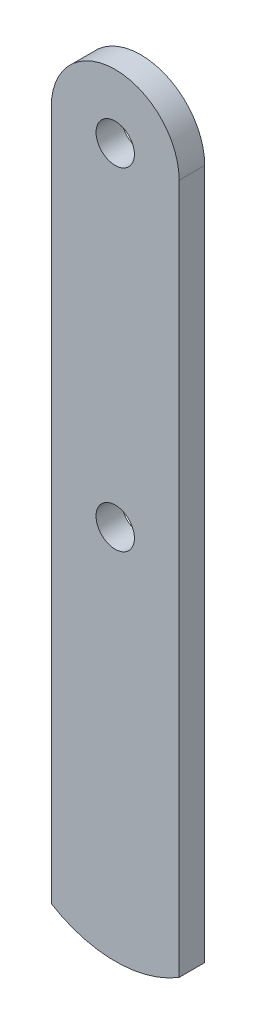
ISO-10303-21;
HEADER;
FILE_DESCRIPTION(('STEP AP214'),'2;1');
FILE_NAME('part.step','',(''),(''),'','','');
FILE_SCHEMA(('AUTOMOTIVE_DESIGN { 1 0 10303 214 1 1 1 1 }'));
ENDSEC;
DATA;
#1=APPLICATION_CONTEXT('core data for automotive mechanical design processes');
#2=APPLICATION_PROTOCOL_DEFINITION('international standard','automotive_design',2000,#1);
#3=PRODUCT_CONTEXT('',#1,'mechanical');
#4=PRODUCT('Part','Part','',(#3));
#5=PRODUCT_RELATED_PRODUCT_CATEGORY('part','',(#4));
#6=PRODUCT_DEFINITION_FORMATION('','',#4);
#7=PRODUCT_DEFINITION_CONTEXT('part definition',#1,'design');
#8=PRODUCT_DEFINITION('design','',#6,#7);
#9=PRODUCT_DEFINITION_SHAPE('','',#8);
#10=(LENGTH_UNIT() NAMED_UNIT(*) SI_UNIT(.MILLI.,.METRE.));
#11=(NAMED_UNIT(*) PLANE_ANGLE_UNIT() SI_UNIT($,.RADIAN.));
#12=(NAMED_UNIT(*) SI_UNIT($,.STERADIAN.) SOLID_ANGLE_UNIT());
#13=UNCERTAINTY_MEASURE_WITH_UNIT(LENGTH_MEASURE(1.E-05),#10,'distance_accuracy_value','');
#14=(GEOMETRIC_REPRESENTATION_CONTEXT(3) GLOBAL_UNCERTAINTY_ASSIGNED_CONTEXT((#13)) GLOBAL_UNIT_ASSIGNED_CONTEXT((#10,
#11,#12)) REPRESENTATION_CONTEXT('',''));
#15=CARTESIAN_POINT('',(0.,0.,0.));
#16=DIRECTION('',(0.,0.,1.));
#17=DIRECTION('',(1.,0.,0.));
#18=AXIS2_PLACEMENT_3D('',#15,#16,#17);
#19=CARTESIAN_POINT('',(0.,-21.364848451745,2.));
#20=DIRECTION('',(0.,0.,-1.));
#21=DIRECTION('',(-1.,0.,0.));
#22=AXIS2_PLACEMENT_3D('',#19,#20,#21);
#23=PLANE('',#22);
#24=CARTESIAN_POINT('',(0.,24.5,2.));
#25=DIRECTION('',(0.,0.,1.));
#26=DIRECTION('',(1.,0.,0.));
#27=AXIS2_PLACEMENT_3D('',#24,#25,#26);
#28=CIRCLE('',#27,1.5);
#29=CARTESIAN_POINT('',(1.5,24.5,2.));
#30=VERTEX_POINT('',#29);
#31=EDGE_CURVE('E101',#30,#30,#28,.T.);
#32=ORIENTED_EDGE('',*,*,#31,.F.);
#33=EDGE_LOOP('',(#32));
#34=FACE_BOUND('',#33,.T.);
#35=CARTESIAN_POINT('',(0.,-21.364848451745,2.));
#36=DIRECTION('',(0.,0.,1.));
#37=DIRECTION('',(-1.,0.,0.));
#38=AXIS2_PLACEMENT_3D('',#35,#36,#37);
#39=CIRCLE('',#38,9.54885808424625);
#40=CARTESIAN_POINT('',(-5.,-29.5,2.));
#41=VERTEX_POINT('',#40);
#42=CARTESIAN_POINT('',(5.,-29.5,2.));
#43=VERTEX_POINT('',#42);
#44=EDGE_CURVE('E86',#41,#43,#39,.T.);
#45=ORIENTED_EDGE('',*,*,#44,.T.);
#46=DIRECTION('',(0.,1.,0.));
#47=VECTOR('',#46,1.);
#48=CARTESIAN_POINT('',(5.,24.5,2.));
#49=LINE('',#48,#47);
#50=CARTESIAN_POINT('',(5.,24.5,2.));
#51=VERTEX_POINT('',#50);
#52=EDGE_CURVE('E81',#43,#51,#49,.T.);
#53=ORIENTED_EDGE('',*,*,#52,.T.);
#54=CARTESIAN_POINT('',(0.,24.5,2.));
#55=DIRECTION('',(0.,0.,1.));
#56=DIRECTION('',(1.,0.,0.));
#57=AXIS2_PLACEMENT_3D('',#54,#55,#56);
#58=CIRCLE('',#57,5.);
#59=CARTESIAN_POINT('',(-5.,24.5,2.));
#60=VERTEX_POINT('',#59);
#61=EDGE_CURVE('E84',#51,#60,#58,.T.);
#62=ORIENTED_EDGE('',*,*,#61,.T.);
#63=DIRECTION('',(0.,-1.,0.));
#64=VECTOR('',#63,1.);
#65=CARTESIAN_POINT('',(-5.,24.5,2.));
#66=LINE('',#65,#64);
#67=EDGE_CURVE('E51',#60,#41,#66,.T.);
#68=ORIENTED_EDGE('',*,*,#67,.T.);
#69=EDGE_LOOP('',(#45,#53,#62,#68));
#70=FACE_BOUND('',#69,.T.);
#71=CARTESIAN_POINT('',(0.,-1.49999999999999,2.));
#72=DIRECTION('',(0.,0.,1.));
#73=DIRECTION('',(1.,0.,0.));
#74=AXIS2_PLACEMENT_3D('',#71,#72,#73);
#75=CIRCLE('',#74,1.5);
#76=CARTESIAN_POINT('',(1.5,-1.49999999999999,2.));
#77=VERTEX_POINT('',#76);
#78=EDGE_CURVE('E116',#77,#77,#75,.T.);
#79=ORIENTED_EDGE('',*,*,#78,.F.);
#80=EDGE_LOOP('',(#79));
#81=FACE_BOUND('',#80,.T.);
#82=ADVANCED_FACE('F34',(#34,#70,#81),#23,.F.);
#83=CARTESIAN_POINT('',(0.,-21.364848451745,0.));
#84=DIRECTION('',(0.,0.,-1.));
#85=DIRECTION('',(-1.,0.,0.));
#86=AXIS2_PLACEMENT_3D('',#83,#84,#85);
#87=PLANE('',#86);
#88=CARTESIAN_POINT('',(0.,24.5,0.));
#89=DIRECTION('',(0.,0.,1.));
#90=DIRECTION('',(1.,0.,0.));
#91=AXIS2_PLACEMENT_3D('',#88,#89,#90);
#92=CIRCLE('',#91,1.5);
#93=CARTESIAN_POINT('',(1.5,24.5,0.));
#94=VERTEX_POINT('',#93);
#95=EDGE_CURVE('E113',#94,#94,#92,.T.);
#96=ORIENTED_EDGE('',*,*,#95,.T.);
#97=EDGE_LOOP('',(#96));
#98=FACE_BOUND('',#97,.T.);
#99=CARTESIAN_POINT('',(0.,-21.364848451745,0.));
#100=DIRECTION('',(0.,0.,1.));
#101=DIRECTION('',(-1.,0.,0.));
#102=AXIS2_PLACEMENT_3D('',#99,#100,#101);
#103=CIRCLE('',#102,9.54885808424625);
#104=CARTESIAN_POINT('',(-5.,-29.5,0.));
#105=VERTEX_POINT('',#104);
#106=CARTESIAN_POINT('',(5.,-29.5,0.));
#107=VERTEX_POINT('',#106);
#108=EDGE_CURVE('E98',#105,#107,#103,.T.);
#109=ORIENTED_EDGE('',*,*,#108,.F.);
#110=DIRECTION('',(0.,-1.,0.));
#111=VECTOR('',#110,1.);
#112=CARTESIAN_POINT('',(-5.,24.5,0.));
#113=LINE('',#112,#111);
#114=CARTESIAN_POINT('',(-5.,24.5,0.));
#115=VERTEX_POINT('',#114);
#116=EDGE_CURVE('E74',#115,#105,#113,.T.);
#117=ORIENTED_EDGE('',*,*,#116,.F.);
#118=CARTESIAN_POINT('',(0.,24.5,0.));
#119=DIRECTION('',(0.,0.,1.));
#120=DIRECTION('',(1.,0.,0.));
#121=AXIS2_PLACEMENT_3D('',#118,#119,#120);
#122=CIRCLE('',#121,5.);
#123=CARTESIAN_POINT('',(5.,24.5,0.));
#124=VERTEX_POINT('',#123);
#125=EDGE_CURVE('E68',#124,#115,#122,.T.);
#126=ORIENTED_EDGE('',*,*,#125,.F.);
#127=DIRECTION('',(0.,1.,0.));
#128=VECTOR('',#127,1.);
#129=CARTESIAN_POINT('',(5.,24.5,0.));
#130=LINE('',#129,#128);
#131=EDGE_CURVE('E90',#107,#124,#130,.T.);
#132=ORIENTED_EDGE('',*,*,#131,.F.);
#133=EDGE_LOOP('',(#109,#117,#126,#132));
#134=FACE_BOUND('',#133,.T.);
#135=CARTESIAN_POINT('',(0.,-1.49999999999999,0.));
#136=DIRECTION('',(0.,0.,1.));
#137=DIRECTION('',(1.,0.,0.));
#138=AXIS2_PLACEMENT_3D('',#135,#136,#137);
#139=CIRCLE('',#138,1.5);
#140=CARTESIAN_POINT('',(1.5,-1.49999999999999,0.));
#141=VERTEX_POINT('',#140);
#142=EDGE_CURVE('E119',#141,#141,#139,.T.);
#143=ORIENTED_EDGE('',*,*,#142,.T.);
#144=EDGE_LOOP('',(#143));
#145=FACE_BOUND('',#144,.T.);
#146=ADVANCED_FACE('F109',(#98,#134,#145),#87,.T.);
#147=CARTESIAN_POINT('',(0.,-21.364848451745,2.));
#148=DIRECTION('',(0.,0.,-1.));
#149=DIRECTION('',(-1.,0.,0.));
#150=AXIS2_PLACEMENT_3D('',#147,#148,#149);
#151=CYLINDRICAL_SURFACE('',#150,9.54885808424625);
#152=ORIENTED_EDGE('',*,*,#108,.T.);
#153=DIRECTION('',(0.,0.,-1.));
#154=VECTOR('',#153,1.);
#155=CARTESIAN_POINT('',(5.,-29.5,2.));
#156=LINE('',#155,#154);
#157=EDGE_CURVE('E11',#43,#107,#156,.T.);
#158=ORIENTED_EDGE('',*,*,#157,.F.);
#159=ORIENTED_EDGE('',*,*,#44,.F.);
#160=DIRECTION('',(0.,0.,-1.));
#161=VECTOR('',#160,1.);
#162=CARTESIAN_POINT('',(-5.,-29.5,2.));
#163=LINE('',#162,#161);
#164=EDGE_CURVE('E94',#41,#105,#163,.T.);
#165=ORIENTED_EDGE('',*,*,#164,.T.);
#166=EDGE_LOOP('',(#152,#158,#159,#165));
#167=FACE_BOUND('',#166,.T.);
#168=ADVANCED_FACE('F36',(#167),#151,.T.);
#169=CARTESIAN_POINT('',(5.,24.5,2.));
#170=DIRECTION('',(-1.,0.,0.));
#171=DIRECTION('',(0.,-1.,0.));
#172=AXIS2_PLACEMENT_3D('',#169,#170,#171);
#173=PLANE('',#172);
#174=ORIENTED_EDGE('',*,*,#131,.T.);
#175=DIRECTION('',(0.,0.,-1.));
#176=VECTOR('',#175,1.);
#177=CARTESIAN_POINT('',(5.,24.5,2.));
#178=LINE('',#177,#176);
#179=EDGE_CURVE('E43',#51,#124,#178,.T.);
#180=ORIENTED_EDGE('',*,*,#179,.F.);
#181=ORIENTED_EDGE('',*,*,#52,.F.);
#182=ORIENTED_EDGE('',*,*,#157,.T.);
#183=EDGE_LOOP('',(#174,#180,#181,#182));
#184=FACE_BOUND('',#183,.T.);
#185=ADVANCED_FACE('F89',(#184),#173,.F.);
#186=CARTESIAN_POINT('',(0.,24.5,2.));
#187=DIRECTION('',(0.,0.,-1.));
#188=DIRECTION('',(-1.,0.,0.));
#189=AXIS2_PLACEMENT_3D('',#186,#187,#188);
#190=CYLINDRICAL_SURFACE('',#189,5.);
#191=ORIENTED_EDGE('',*,*,#125,.T.);
#192=DIRECTION('',(0.,0.,-1.));
#193=VECTOR('',#192,1.);
#194=CARTESIAN_POINT('',(-5.,24.5,2.));
#195=LINE('',#194,#193);
#196=EDGE_CURVE('E91',#60,#115,#195,.T.);
#197=ORIENTED_EDGE('',*,*,#196,.F.);
#198=ORIENTED_EDGE('',*,*,#61,.F.);
#199=ORIENTED_EDGE('',*,*,#179,.T.);
#200=EDGE_LOOP('',(#191,#197,#198,#199));
#201=FACE_BOUND('',#200,.T.);
#202=ADVANCED_FACE('F92',(#201),#190,.T.);
#203=CARTESIAN_POINT('',(-5.,24.5,2.));
#204=DIRECTION('',(1.,0.,0.));
#205=DIRECTION('',(0.,1.,0.));
#206=AXIS2_PLACEMENT_3D('',#203,#204,#205);
#207=PLANE('',#206);
#208=ORIENTED_EDGE('',*,*,#116,.T.);
#209=ORIENTED_EDGE('',*,*,#164,.F.);
#210=ORIENTED_EDGE('',*,*,#67,.F.);
#211=ORIENTED_EDGE('',*,*,#196,.T.);
#212=EDGE_LOOP('',(#208,#209,#210,#211));
#213=FACE_BOUND('',#212,.T.);
#214=ADVANCED_FACE('F106',(#213),#207,.F.);
#215=CARTESIAN_POINT('',(0.,24.5,2.));
#216=DIRECTION('',(0.,0.,-1.));
#217=DIRECTION('',(-1.,0.,0.));
#218=AXIS2_PLACEMENT_3D('',#215,#216,#217);
#219=CYLINDRICAL_SURFACE('',#218,1.5);
#220=ORIENTED_EDGE('',*,*,#31,.T.);
#221=EDGE_LOOP('',(#220));
#222=FACE_BOUND('',#221,.T.);
#223=ORIENTED_EDGE('',*,*,#95,.F.);
#224=EDGE_LOOP('',(#223));
#225=FACE_BOUND('',#224,.T.);
#226=ADVANCED_FACE('F137',(#222,#225),#219,.F.);
#227=CARTESIAN_POINT('',(0.,-1.49999999999999,2.));
#228=DIRECTION('',(0.,0.,-1.));
#229=DIRECTION('',(-1.,0.,0.));
#230=AXIS2_PLACEMENT_3D('',#227,#228,#229);
#231=CYLINDRICAL_SURFACE('',#230,1.5);
#232=ORIENTED_EDGE('',*,*,#78,.T.);
#233=EDGE_LOOP('',(#232));
#234=FACE_BOUND('',#233,.T.);
#235=ORIENTED_EDGE('',*,*,#142,.F.);
#236=EDGE_LOOP('',(#235));
#237=FACE_BOUND('',#236,.T.);
#238=ADVANCED_FACE('F125',(#234,#237),#231,.F.);
#239=CLOSED_SHELL('',(#82,#146,#168,#185,#202,#214,#226,#238));
#240=MANIFOLD_SOLID_BREP('B2',#239);
#241=ADVANCED_BREP_SHAPE_REPRESENTATION('',(#18,#240),#14);
#242=SHAPE_DEFINITION_REPRESENTATION(#9,#241);
ENDSEC;
END-ISO-10303-21;
